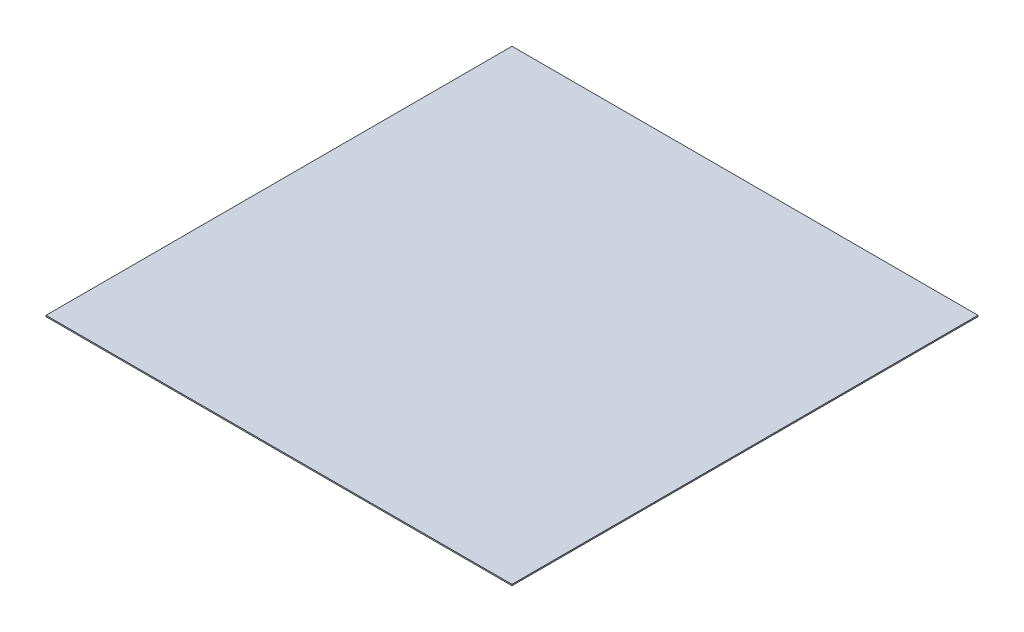
ISO-10303-21;
HEADER;
FILE_DESCRIPTION(('STEP AP214'),'2;1');
FILE_NAME('part.step','',(''),(''),'','','');
FILE_SCHEMA(('AUTOMOTIVE_DESIGN { 1 0 10303 214 1 1 1 1 }'));
ENDSEC;
DATA;
#1=APPLICATION_CONTEXT('core data for automotive mechanical design processes');
#2=APPLICATION_PROTOCOL_DEFINITION('international standard','automotive_design',2000,#1);
#3=PRODUCT_CONTEXT('',#1,'mechanical');
#4=PRODUCT('Part','Part','',(#3));
#5=PRODUCT_RELATED_PRODUCT_CATEGORY('part','',(#4));
#6=PRODUCT_DEFINITION_FORMATION('','',#4);
#7=PRODUCT_DEFINITION_CONTEXT('part definition',#1,'design');
#8=PRODUCT_DEFINITION('design','',#6,#7);
#9=PRODUCT_DEFINITION_SHAPE('','',#8);
#10=(LENGTH_UNIT() NAMED_UNIT(*) SI_UNIT(.MILLI.,.METRE.));
#11=(NAMED_UNIT(*) PLANE_ANGLE_UNIT() SI_UNIT($,.RADIAN.));
#12=(NAMED_UNIT(*) SI_UNIT($,.STERADIAN.) SOLID_ANGLE_UNIT());
#13=UNCERTAINTY_MEASURE_WITH_UNIT(LENGTH_MEASURE(1.E-05),#10,'distance_accuracy_value','');
#14=(GEOMETRIC_REPRESENTATION_CONTEXT(3) GLOBAL_UNCERTAINTY_ASSIGNED_CONTEXT((#13)) GLOBAL_UNIT_ASSIGNED_CONTEXT((#10,
#11,#12)) REPRESENTATION_CONTEXT('',''));
#15=CARTESIAN_POINT('',(0.,0.,0.));
#16=DIRECTION('',(0.,0.,1.));
#17=DIRECTION('',(1.,0.,0.));
#18=AXIS2_PLACEMENT_3D('',#15,#16,#17);
#19=CARTESIAN_POINT('',(-75.,0.4,75.));
#20=DIRECTION('',(1.,0.,0.));
#21=DIRECTION('',(0.,0.,-1.));
#22=AXIS2_PLACEMENT_3D('',#19,#20,#21);
#23=PLANE('',#22);
#24=DIRECTION('',(0.,0.,1.));
#25=VECTOR('',#24,1.);
#26=CARTESIAN_POINT('',(-75.,0.,75.));
#27=LINE('',#26,#25);
#28=CARTESIAN_POINT('',(-75.,0.,-75.));
#29=VERTEX_POINT('',#28);
#30=CARTESIAN_POINT('',(-75.,0.,75.));
#31=VERTEX_POINT('',#30);
#32=EDGE_CURVE('E107',#29,#31,#27,.T.);
#33=ORIENTED_EDGE('',*,*,#32,.T.);
#34=DIRECTION('',(0.,-1.,0.));
#35=VECTOR('',#34,1.);
#36=CARTESIAN_POINT('',(-75.,0.4,75.));
#37=LINE('',#36,#35);
#38=CARTESIAN_POINT('',(-75.,0.4,75.));
#39=VERTEX_POINT('',#38);
#40=EDGE_CURVE('E11',#39,#31,#37,.T.);
#41=ORIENTED_EDGE('',*,*,#40,.F.);
#42=DIRECTION('',(0.,0.,1.));
#43=VECTOR('',#42,1.);
#44=CARTESIAN_POINT('',(-75.,0.4,75.));
#45=LINE('',#44,#43);
#46=CARTESIAN_POINT('',(-75.,0.4,-75.));
#47=VERTEX_POINT('',#46);
#48=EDGE_CURVE('E91',#47,#39,#45,.T.);
#49=ORIENTED_EDGE('',*,*,#48,.F.);
#50=DIRECTION('',(0.,-1.,0.));
#51=VECTOR('',#50,1.);
#52=CARTESIAN_POINT('',(-75.,0.4,-75.));
#53=LINE('',#52,#51);
#54=EDGE_CURVE('E103',#47,#29,#53,.T.);
#55=ORIENTED_EDGE('',*,*,#54,.T.);
#56=EDGE_LOOP('',(#33,#41,#49,#55));
#57=FACE_BOUND('',#56,.T.);
#58=ADVANCED_FACE('F39',(#57),#23,.F.);
#59=CARTESIAN_POINT('',(75.,0.4,75.));
#60=DIRECTION('',(0.,0.,-1.));
#61=DIRECTION('',(-1.,0.,0.));
#62=AXIS2_PLACEMENT_3D('',#59,#60,#61);
#63=PLANE('',#62);
#64=DIRECTION('',(1.,0.,0.));
#65=VECTOR('',#64,1.);
#66=CARTESIAN_POINT('',(75.,0.,75.));
#67=LINE('',#66,#65);
#68=CARTESIAN_POINT('',(75.,0.,75.));
#69=VERTEX_POINT('',#68);
#70=EDGE_CURVE('E96',#31,#69,#67,.T.);
#71=ORIENTED_EDGE('',*,*,#70,.T.);
#72=DIRECTION('',(0.,-1.,0.));
#73=VECTOR('',#72,1.);
#74=CARTESIAN_POINT('',(75.,0.4,75.));
#75=LINE('',#74,#73);
#76=CARTESIAN_POINT('',(75.,0.4,75.));
#77=VERTEX_POINT('',#76);
#78=EDGE_CURVE('E48',#77,#69,#75,.T.);
#79=ORIENTED_EDGE('',*,*,#78,.F.);
#80=DIRECTION('',(1.,0.,0.));
#81=VECTOR('',#80,1.);
#82=CARTESIAN_POINT('',(75.,0.4,75.));
#83=LINE('',#82,#81);
#84=EDGE_CURVE('E86',#39,#77,#83,.T.);
#85=ORIENTED_EDGE('',*,*,#84,.F.);
#86=ORIENTED_EDGE('',*,*,#40,.T.);
#87=EDGE_LOOP('',(#71,#79,#85,#86));
#88=FACE_BOUND('',#87,.T.);
#89=ADVANCED_FACE('F95',(#88),#63,.F.);
#90=CARTESIAN_POINT('',(75.,0.4,75.));
#91=DIRECTION('',(-1.,0.,0.));
#92=DIRECTION('',(0.,0.,1.));
#93=AXIS2_PLACEMENT_3D('',#90,#91,#92);
#94=PLANE('',#93);
#95=DIRECTION('',(0.,0.,-1.));
#96=VECTOR('',#95,1.);
#97=CARTESIAN_POINT('',(75.,0.,75.));
#98=LINE('',#97,#96);
#99=CARTESIAN_POINT('',(75.,0.,-75.));
#100=VERTEX_POINT('',#99);
#101=EDGE_CURVE('E73',#69,#100,#98,.T.);
#102=ORIENTED_EDGE('',*,*,#101,.T.);
#103=DIRECTION('',(0.,-1.,0.));
#104=VECTOR('',#103,1.);
#105=CARTESIAN_POINT('',(75.,0.4,-75.));
#106=LINE('',#105,#104);
#107=CARTESIAN_POINT('',(75.,0.4,-75.));
#108=VERTEX_POINT('',#107);
#109=EDGE_CURVE('E98',#108,#100,#106,.T.);
#110=ORIENTED_EDGE('',*,*,#109,.F.);
#111=DIRECTION('',(0.,0.,-1.));
#112=VECTOR('',#111,1.);
#113=CARTESIAN_POINT('',(75.,0.4,75.));
#114=LINE('',#113,#112);
#115=EDGE_CURVE('E89',#77,#108,#114,.T.);
#116=ORIENTED_EDGE('',*,*,#115,.F.);
#117=ORIENTED_EDGE('',*,*,#78,.T.);
#118=EDGE_LOOP('',(#102,#110,#116,#117));
#119=FACE_BOUND('',#118,.T.);
#120=ADVANCED_FACE('F99',(#119),#94,.F.);
#121=CARTESIAN_POINT('',(75.,0.4,-75.));
#122=DIRECTION('',(0.,0.,1.));
#123=DIRECTION('',(1.,0.,0.));
#124=AXIS2_PLACEMENT_3D('',#121,#122,#123);
#125=PLANE('',#124);
#126=DIRECTION('',(-1.,0.,0.));
#127=VECTOR('',#126,1.);
#128=CARTESIAN_POINT('',(75.,0.,-75.));
#129=LINE('',#128,#127);
#130=EDGE_CURVE('E79',#100,#29,#129,.T.);
#131=ORIENTED_EDGE('',*,*,#130,.T.);
#132=ORIENTED_EDGE('',*,*,#54,.F.);
#133=DIRECTION('',(-1.,0.,0.));
#134=VECTOR('',#133,1.);
#135=CARTESIAN_POINT('',(75.,0.4,-75.));
#136=LINE('',#135,#134);
#137=EDGE_CURVE('E56',#108,#47,#136,.T.);
#138=ORIENTED_EDGE('',*,*,#137,.F.);
#139=ORIENTED_EDGE('',*,*,#109,.T.);
#140=EDGE_LOOP('',(#131,#132,#138,#139));
#141=FACE_BOUND('',#140,.T.);
#142=ADVANCED_FACE('F120',(#141),#125,.F.);
#143=CARTESIAN_POINT('',(0.,0.4,0.));
#144=DIRECTION('',(0.,1.,0.));
#145=DIRECTION('',(0.,0.,1.));
#146=AXIS2_PLACEMENT_3D('',#143,#144,#145);
#147=PLANE('',#146);
#148=ORIENTED_EDGE('',*,*,#48,.T.);
#149=ORIENTED_EDGE('',*,*,#84,.T.);
#150=ORIENTED_EDGE('',*,*,#115,.T.);
#151=ORIENTED_EDGE('',*,*,#137,.T.);
#152=EDGE_LOOP('',(#148,#149,#150,#151));
#153=FACE_BOUND('',#152,.T.);
#154=ADVANCED_FACE('F87',(#153),#147,.T.);
#155=CARTESIAN_POINT('',(0.,0.,0.));
#156=DIRECTION('',(0.,1.,0.));
#157=DIRECTION('',(0.,0.,1.));
#158=AXIS2_PLACEMENT_3D('',#155,#156,#157);
#159=PLANE('',#158);
#160=ORIENTED_EDGE('',*,*,#32,.F.);
#161=ORIENTED_EDGE('',*,*,#130,.F.);
#162=ORIENTED_EDGE('',*,*,#101,.F.);
#163=ORIENTED_EDGE('',*,*,#70,.F.);
#164=EDGE_LOOP('',(#160,#161,#162,#163));
#165=FACE_BOUND('',#164,.T.);
#166=ADVANCED_FACE('F123',(#165),#159,.F.);
#167=CLOSED_SHELL('',(#58,#89,#120,#142,#154,#166));
#168=MANIFOLD_SOLID_BREP('B2',#167);
#169=ADVANCED_BREP_SHAPE_REPRESENTATION('',(#18,#168),#14);
#170=SHAPE_DEFINITION_REPRESENTATION(#9,#169);
ENDSEC;
END-ISO-10303-21;
